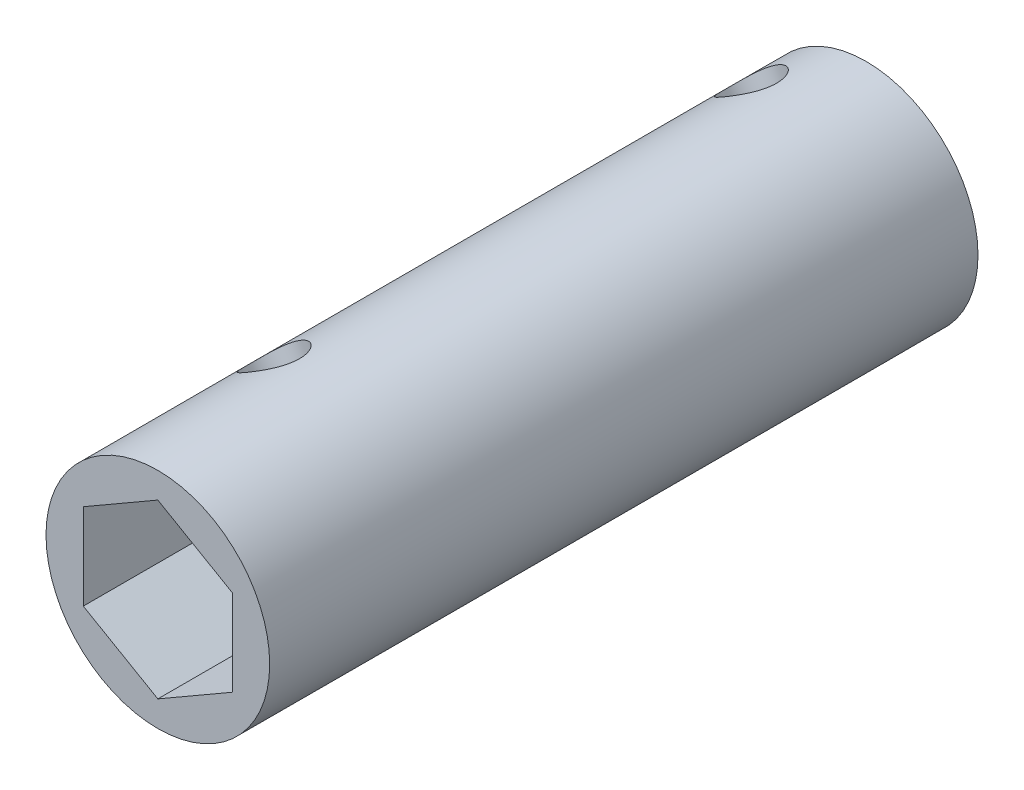
ISO-10303-21;
HEADER;
FILE_DESCRIPTION(('STEP AP214'),'2;1');
FILE_NAME('part.step','',(''),(''),'','','');
FILE_SCHEMA(('AUTOMOTIVE_DESIGN { 1 0 10303 214 1 1 1 1 }'));
ENDSEC;
DATA;
#1=APPLICATION_CONTEXT('core data for automotive mechanical design processes');
#2=APPLICATION_PROTOCOL_DEFINITION('international standard','automotive_design',2000,#1);
#3=PRODUCT_CONTEXT('',#1,'mechanical');
#4=PRODUCT('Part','Part','',(#3));
#5=PRODUCT_RELATED_PRODUCT_CATEGORY('part','',(#4));
#6=PRODUCT_DEFINITION_FORMATION('','',#4);
#7=PRODUCT_DEFINITION_CONTEXT('part definition',#1,'design');
#8=PRODUCT_DEFINITION('design','',#6,#7);
#9=PRODUCT_DEFINITION_SHAPE('','',#8);
#10=(LENGTH_UNIT() NAMED_UNIT(*) SI_UNIT(.MILLI.,.METRE.));
#11=(NAMED_UNIT(*) PLANE_ANGLE_UNIT() SI_UNIT($,.RADIAN.));
#12=(NAMED_UNIT(*) SI_UNIT($,.STERADIAN.) SOLID_ANGLE_UNIT());
#13=UNCERTAINTY_MEASURE_WITH_UNIT(LENGTH_MEASURE(1.E-05),#10,'distance_accuracy_value','');
#14=(GEOMETRIC_REPRESENTATION_CONTEXT(3) GLOBAL_UNCERTAINTY_ASSIGNED_CONTEXT((#13)) GLOBAL_UNIT_ASSIGNED_CONTEXT((#10,
#11,#12)) REPRESENTATION_CONTEXT('',''));
#15=CARTESIAN_POINT('',(0.,0.,0.));
#16=DIRECTION('',(0.,0.,1.));
#17=DIRECTION('',(1.,0.,0.));
#18=AXIS2_PLACEMENT_3D('',#15,#16,#17);
#19=CARTESIAN_POINT('',(0.,0.,60.325));
#20=DIRECTION('',(0.,0.,1.));
#21=DIRECTION('',(1.,0.,0.));
#22=AXIS2_PLACEMENT_3D('',#19,#20,#21);
#23=PLANE('',#22);
#24=CARTESIAN_POINT('',(0.,0.,60.325));
#25=DIRECTION('',(0.,0.,1.));
#26=DIRECTION('',(1.,0.,0.));
#27=AXIS2_PLACEMENT_3D('',#24,#25,#26);
#28=CIRCLE('',#27,9.525);
#29=CARTESIAN_POINT('',(9.525,0.,60.325));
#30=VERTEX_POINT('',#29);
#31=EDGE_CURVE('E11',#30,#30,#28,.T.);
#32=ORIENTED_EDGE('',*,*,#31,.T.);
#33=EDGE_LOOP('',(#32));
#34=FACE_BOUND('',#33,.T.);
#35=DIRECTION('',(-0.866025403784439,0.5,0.));
#36=VECTOR('',#35,1.);
#37=CARTESIAN_POINT('',(6.35,3.66617420935412,60.325));
#38=LINE('',#37,#36);
#39=CARTESIAN_POINT('',(6.35,3.66617420935412,60.325));
#40=VERTEX_POINT('',#39);
#41=CARTESIAN_POINT('',(0.,7.33234841870824,60.325));
#42=VERTEX_POINT('',#41);
#43=EDGE_CURVE('E105',#40,#42,#38,.T.);
#44=ORIENTED_EDGE('',*,*,#43,.F.);
#45=DIRECTION('',(0.,1.,0.));
#46=VECTOR('',#45,1.);
#47=CARTESIAN_POINT('',(6.35,-3.66617420935413,60.325));
#48=LINE('',#47,#46);
#49=CARTESIAN_POINT('',(6.35,-3.66617420935413,60.325));
#50=VERTEX_POINT('',#49);
#51=EDGE_CURVE('E97',#50,#40,#48,.T.);
#52=ORIENTED_EDGE('',*,*,#51,.F.);
#53=DIRECTION('',(0.866025403784439,0.5,0.));
#54=VECTOR('',#53,1.);
#55=CARTESIAN_POINT('',(0.,-7.33234841870825,60.325));
#56=LINE('',#55,#54);
#57=CARTESIAN_POINT('',(0.,-7.33234841870825,60.325));
#58=VERTEX_POINT('',#57);
#59=EDGE_CURVE('E126',#58,#50,#56,.T.);
#60=ORIENTED_EDGE('',*,*,#59,.F.);
#61=DIRECTION('',(0.866025403784439,-0.5,0.));
#62=VECTOR('',#61,1.);
#63=CARTESIAN_POINT('',(-6.34999999999999,-3.66617420935413,60.325));
#64=LINE('',#63,#62);
#65=CARTESIAN_POINT('',(-6.34999999999999,-3.66617420935413,60.325));
#66=VERTEX_POINT('',#65);
#67=EDGE_CURVE('E124',#66,#58,#64,.T.);
#68=ORIENTED_EDGE('',*,*,#67,.F.);
#69=DIRECTION('',(0.,-1.,0.));
#70=VECTOR('',#69,1.);
#71=CARTESIAN_POINT('',(-6.35,3.66617420935412,60.325));
#72=LINE('',#71,#70);
#73=CARTESIAN_POINT('',(-6.35,3.66617420935412,60.325));
#74=VERTEX_POINT('',#73);
#75=EDGE_CURVE('E119',#74,#66,#72,.T.);
#76=ORIENTED_EDGE('',*,*,#75,.F.);
#77=DIRECTION('',(-0.866025403784439,-0.5,0.));
#78=VECTOR('',#77,1.);
#79=CARTESIAN_POINT('',(0.,7.33234841870824,60.325));
#80=LINE('',#79,#78);
#81=EDGE_CURVE('E117',#42,#74,#80,.T.);
#82=ORIENTED_EDGE('',*,*,#81,.F.);
#83=EDGE_LOOP('',(#44,#52,#60,#68,#76,#82));
#84=FACE_BOUND('',#83,.T.);
#85=ADVANCED_FACE('F41',(#34,#84),#23,.T.);
#86=CARTESIAN_POINT('',(0.,0.,0.));
#87=DIRECTION('',(0.,0.,1.));
#88=DIRECTION('',(1.,0.,0.));
#89=AXIS2_PLACEMENT_3D('',#86,#87,#88);
#90=PLANE('',#89);
#91=CARTESIAN_POINT('',(0.,0.,0.));
#92=DIRECTION('',(0.,0.,1.));
#93=DIRECTION('',(1.,0.,0.));
#94=AXIS2_PLACEMENT_3D('',#91,#92,#93);
#95=CIRCLE('',#94,9.525);
#96=CARTESIAN_POINT('',(9.525,0.,0.));
#97=VERTEX_POINT('',#96);
#98=EDGE_CURVE('E51',#97,#97,#95,.T.);
#99=ORIENTED_EDGE('',*,*,#98,.F.);
#100=EDGE_LOOP('',(#99));
#101=FACE_BOUND('',#100,.T.);
#102=DIRECTION('',(0.,1.,0.));
#103=VECTOR('',#102,1.);
#104=CARTESIAN_POINT('',(6.35,-3.66617420935413,0.));
#105=LINE('',#104,#103);
#106=CARTESIAN_POINT('',(6.35,-3.66617420935413,0.));
#107=VERTEX_POINT('',#106);
#108=CARTESIAN_POINT('',(6.35,3.66617420935412,0.));
#109=VERTEX_POINT('',#108);
#110=EDGE_CURVE('E67',#107,#109,#105,.T.);
#111=ORIENTED_EDGE('',*,*,#110,.T.);
#112=DIRECTION('',(-0.866025403784439,0.5,0.));
#113=VECTOR('',#112,1.);
#114=CARTESIAN_POINT('',(6.35,3.66617420935412,0.));
#115=LINE('',#114,#113);
#116=CARTESIAN_POINT('',(0.,7.33234841870824,0.));
#117=VERTEX_POINT('',#116);
#118=EDGE_CURVE('E112',#109,#117,#115,.T.);
#119=ORIENTED_EDGE('',*,*,#118,.T.);
#120=DIRECTION('',(-0.866025403784439,-0.5,0.));
#121=VECTOR('',#120,1.);
#122=CARTESIAN_POINT('',(0.,7.33234841870824,0.));
#123=LINE('',#122,#121);
#124=CARTESIAN_POINT('',(-6.35,3.66617420935412,0.));
#125=VERTEX_POINT('',#124);
#126=EDGE_CURVE('E131',#117,#125,#123,.T.);
#127=ORIENTED_EDGE('',*,*,#126,.T.);
#128=DIRECTION('',(0.,-1.,0.));
#129=VECTOR('',#128,1.);
#130=CARTESIAN_POINT('',(-6.35,3.66617420935412,0.));
#131=LINE('',#130,#129);
#132=CARTESIAN_POINT('',(-6.34999999999999,-3.66617420935413,0.));
#133=VERTEX_POINT('',#132);
#134=EDGE_CURVE('E134',#125,#133,#131,.T.);
#135=ORIENTED_EDGE('',*,*,#134,.T.);
#136=DIRECTION('',(0.866025403784439,-0.5,0.));
#137=VECTOR('',#136,1.);
#138=CARTESIAN_POINT('',(-6.34999999999999,-3.66617420935413,0.));
#139=LINE('',#138,#137);
#140=CARTESIAN_POINT('',(0.,-7.33234841870825,0.));
#141=VERTEX_POINT('',#140);
#142=EDGE_CURVE('E137',#133,#141,#139,.T.);
#143=ORIENTED_EDGE('',*,*,#142,.T.);
#144=DIRECTION('',(0.866025403784439,0.5,0.));
#145=VECTOR('',#144,1.);
#146=CARTESIAN_POINT('',(0.,-7.33234841870825,0.));
#147=LINE('',#146,#145);
#148=EDGE_CURVE('E106',#141,#107,#147,.T.);
#149=ORIENTED_EDGE('',*,*,#148,.T.);
#150=EDGE_LOOP('',(#111,#119,#127,#135,#143,#149));
#151=FACE_BOUND('',#150,.T.);
#152=ADVANCED_FACE('F202',(#101,#151),#90,.F.);
#153=CARTESIAN_POINT('',(0.,0.,60.325));
#154=DIRECTION('',(0.,0.,-1.));
#155=DIRECTION('',(-1.,0.,0.));
#156=AXIS2_PLACEMENT_3D('',#153,#154,#155);
#157=CYLINDRICAL_SURFACE('',#156,9.525);
#158=CARTESIAN_POINT('',(2.54904780381651,-9.17758030713206,5.08));
#159=CARTESIAN_POINT('',(2.54905229363295,-9.17758061344205,5.21149334025756));
#160=CARTESIAN_POINT('',(2.55993384077204,-9.17457797390514,5.34302801599129));
#161=CARTESIAN_POINT('',(2.6029817332676,-9.16245566720171,5.60232011821027));
#162=CARTESIAN_POINT('',(2.63516046621715,-9.1533324399287,5.73007530113095));
#163=CARTESIAN_POINT('',(2.71934494253332,-9.12867433907222,5.97802037012329));
#164=CARTESIAN_POINT('',(2.77132508942243,-9.11314774073283,6.09821979050489));
#165=CARTESIAN_POINT('',(2.893035348316,-9.07524198547898,6.32807108704424));
#166=CARTESIAN_POINT('',(2.96276621389893,-9.05286253762954,6.43772251513141));
#167=CARTESIAN_POINT('',(3.11899373347353,-9.00024516889423,6.64577821711226));
#168=CARTESIAN_POINT('',(3.20579560114475,-8.96986013093974,6.74391615433342));
#169=CARTESIAN_POINT('',(3.39224146692954,-8.90102140437571,6.92381272812822));
#170=CARTESIAN_POINT('',(3.49188666422141,-8.86256696211717,7.00556983340472));
#171=CARTESIAN_POINT('',(3.70221396050843,-8.77680428814681,7.15147363291879));
#172=CARTESIAN_POINT('',(3.81303066091311,-8.72938000317114,7.2153586847238));
#173=CARTESIAN_POINT('',(4.04082926959016,-8.6262929657193,7.32200368605581));
#174=CARTESIAN_POINT('',(4.15781026540683,-8.57063143034972,7.36476675244953));
#175=CARTESIAN_POINT('',(4.39168967427931,-8.45313308235405,7.4271008124361));
#176=CARTESIAN_POINT('',(4.50854175187616,-8.39144421303591,7.44712408622107));
#177=CARTESIAN_POINT('',(4.74081493875507,-8.2624412439009,7.46482985625997));
#178=CARTESIAN_POINT('',(4.85623625707456,-8.19512797721623,7.46251565552964));
#179=CARTESIAN_POINT('',(5.0797186533123,-8.05846571853376,7.43593745513674));
#180=CARTESIAN_POINT('',(5.18788622087936,-7.98919504164947,7.4121616503862));
#181=CARTESIAN_POINT('',(5.3968168648691,-7.84957260579019,7.34411986527881));
#182=CARTESIAN_POINT('',(5.49757954680107,-7.77922078945922,7.29985279417802));
#183=CARTESIAN_POINT('',(5.69030416989731,-7.63939650735584,7.19169005142057));
#184=CARTESIAN_POINT('',(5.78217836592552,-7.56993773044561,7.12762063995969));
#185=CARTESIAN_POINT('',(5.95431049924959,-7.43530565734453,6.98180371564176));
#186=CARTESIAN_POINT('',(6.03456641151963,-7.37013310930587,6.900053127196));
#187=CARTESIAN_POINT('',(6.18410203551371,-7.24515508260776,6.7185774232618));
#188=CARTESIAN_POINT('',(6.25302589271482,-7.18554260063019,6.61842571503877));
#189=CARTESIAN_POINT('',(6.37605592968952,-7.07660283159918,6.40435602520288));
#190=CARTESIAN_POINT('',(6.43016141690835,-7.02727602528515,6.29043740053472));
#191=CARTESIAN_POINT('',(6.52288847932546,-6.94129579382732,6.05127374247321));
#192=CARTESIAN_POINT('',(6.56143370244015,-6.90470498042435,5.92597646687705));
#193=CARTESIAN_POINT('',(6.62196022932753,-6.84668129461498,5.66808734165681));
#194=CARTESIAN_POINT('',(6.64394507769142,-6.82524517854973,5.53549705955467));
#195=CARTESIAN_POINT('',(6.6705752897347,-6.79921985587541,5.27053857479275));
#196=CARTESIAN_POINT('',(6.67566329006416,-6.79420063979761,5.13825700184267));
#197=CARTESIAN_POINT('',(6.66964484024437,-6.80010886481148,4.87442960540254));
#198=CARTESIAN_POINT('',(6.65853988085245,-6.81103483795619,4.74288371530316));
#199=CARTESIAN_POINT('',(6.62066792194018,-6.84785021203948,4.48648366263648));
#200=CARTESIAN_POINT('',(6.59416015026167,-6.87349186342222,4.36155522794284));
#201=CARTESIAN_POINT('',(6.52615192018632,-6.93809425809366,4.1194690363947));
#202=CARTESIAN_POINT('',(6.48464968575974,-6.97705657912911,4.00231220199936));
#203=CARTESIAN_POINT('',(6.38635757570423,-7.06714767400292,3.77655968283178));
#204=CARTESIAN_POINT('',(6.32928377083355,-7.11850012554794,3.66817702985906));
#205=CARTESIAN_POINT('',(6.20112529126727,-7.23041442347494,3.4653330844316));
#206=CARTESIAN_POINT('',(6.13003831391223,-7.29097778302894,3.37087408439077));
#207=CARTESIAN_POINT('',(5.97303683874989,-7.42017707150564,3.1961349819512));
#208=CARTESIAN_POINT('',(5.88679584286063,-7.48897706968816,3.11626879042226));
#209=CARTESIAN_POINT('',(5.70238161212303,-7.63033065001022,2.97598858672893));
#210=CARTESIAN_POINT('',(5.60420900003335,-7.70288403613202,2.91557355993068));
#211=CARTESIAN_POINT('',(5.39882155536816,-7.84818729915137,2.81643515211215));
#212=CARTESIAN_POINT('',(5.29167840204569,-7.92093182251274,2.77755576912894));
#213=CARTESIAN_POINT('',(5.0704520816802,-8.06433488929517,2.72212403128549));
#214=CARTESIAN_POINT('',(4.95637025842815,-8.13499383271193,2.70556736755107));
#215=CARTESIAN_POINT('',(4.72767678849472,-8.26993669412325,2.69549342732325));
#216=CARTESIAN_POINT('',(4.61316287025551,-8.33434132579849,2.70136530521656));
#217=CARTESIAN_POINT('',(4.38402560845031,-8.45711779719425,2.73458263874467));
#218=CARTESIAN_POINT('',(4.26940226823992,-8.51548981627303,2.76192745575011));
#219=CARTESIAN_POINT('',(4.0441492787384,-8.62473658142619,2.83698684832936));
#220=CARTESIAN_POINT('',(3.93350145175549,-8.67564999652782,2.88459097320487));
#221=CARTESIAN_POINT('',(3.71889779529251,-8.76978739471325,2.99871744129036));
#222=CARTESIAN_POINT('',(3.61494281142062,-8.81301040736398,3.06524216929659));
#223=CARTESIAN_POINT('',(3.41452745499388,-8.89261172000423,3.21718440095329));
#224=CARTESIAN_POINT('',(3.31830629654328,-8.92880123245951,3.30301634028975));
#225=CARTESIAN_POINT('',(3.1393582537879,-8.99328203277393,3.49033191627106));
#226=CARTESIAN_POINT('',(3.05663479658151,-9.0215713160394,3.59181951523971));
#227=CARTESIAN_POINT('',(2.90620591590505,-9.07116295467689,3.80984461753865));
#228=CARTESIAN_POINT('',(2.83880945928833,-9.09232511646503,3.92662756876351));
#229=CARTESIAN_POINT('',(2.72377748435526,-9.12744783640375,4.17049463526441));
#230=CARTESIAN_POINT('',(2.67612758971469,-9.14141363561731,4.29757117551097));
#231=CARTESIAN_POINT('',(2.60957587047935,-9.16060528619542,4.53368650943248));
#232=CARTESIAN_POINT('',(2.58694292776004,-9.16698406212902,4.64159559769449));
#233=CARTESIAN_POINT('',(2.5566776531051,-9.17547126212705,4.85966024430074));
#234=CARTESIAN_POINT('',(2.54904404159035,-9.17758005046066,4.96981561020698));
#235=CARTESIAN_POINT('',(2.54904780381651,-9.17758030713206,5.08));
#236=B_SPLINE_CURVE_WITH_KNOTS('',3,(#158,#159,#160,#161,#162,#163,#164,#165,#166,#167,#168,
#169,#170,#171,#172,#173,#174,#175,#176,#177,#178,#179,#180,#181,#182,#183,#184,#185,#186,#187,
#188,#189,#190,#191,#192,#193,#194,#195,#196,#197,#198,#199,#200,#201,#202,#203,#204,#205,#206,
#207,#208,#209,#210,#211,#212,#213,#214,#215,#216,#217,#218,#219,#220,#221,#222,#223,#224,#225,
#226,#227,#228,#229,#230,#231,#232,#233,#234,#235),.UNSPECIFIED.,.T.,.F.,(4,2,2,2,2,2,2,2,2,2,2,
2,2,2,2,2,2,2,2,2,2,2,2,2,2,2,2,2,2,2,2,2,2,2,2,2,2,2,4),(0.,0.394075388253669,
0.788380193710805,1.18217701762563,1.57599056234593,1.9776181636881,2.37928329209573,
2.78655300319019,3.19376259754356,3.59272285323068,3.99162411604385,4.38167395211222,
4.77174455280359,5.16533962727358,5.5590032215914,5.96332119409746,6.36765805967812,
6.77395551488003,7.18016598123394,7.57564754962905,7.97109271147282,8.3600677827598,
8.7490889415861,9.14574160685557,9.54245950492715,9.94910377749176,10.3557268347758,
10.7593644935331,11.1629242284057,11.5555723244111,11.9482087430628,12.3387314492783,
12.7293033997022,13.1292323449913,13.5292626757086,13.936755946198,14.343952021097,
14.674194303944,15.0044084129029),.UNSPECIFIED.);
#237=CARTESIAN_POINT('',(2.54904780381651,-9.17758030713206,5.08));
#238=VERTEX_POINT('',#237);
#239=EDGE_CURVE('E129',#238,#238,#236,.T.);
#240=ORIENTED_EDGE('',*,*,#239,.T.);
#241=EDGE_LOOP('',(#240));
#242=FACE_BOUND('',#241,.T.);
#243=CARTESIAN_POINT('',(-6.6734937893399,6.79633030713207,5.08));
#244=CARTESIAN_POINT('',(-6.67349180970392,6.79633434858216,4.94850665974244));
#245=CARTESIAN_POINT('',(-6.66545067401699,6.80425672506863,4.81697198400871));
#246=CARTESIAN_POINT('',(-6.63342850221157,6.83547614019744,4.55767988178973));
#247=CARTESIAN_POINT('',(-6.60943818915388,6.85878212675685,4.42992469886905));
#248=CARTESIAN_POINT('',(-6.545991409245,6.91935897142271,4.18197962987671));
#249=CARTESIAN_POINT('',(-6.50655490720417,6.95661179995143,4.06178020949511));
#250=CARTESIAN_POINT('',(-6.41287243075792,7.04306309842752,3.83192891295576));
#251=CARTESIAN_POINT('',(-6.35862582760617,7.09226207552549,3.72227748486859));
#252=CARTESIAN_POINT('',(-6.2349440898138,7.20125039187966,3.51422178288774));
#253=CARTESIAN_POINT('',(-6.16522894121464,7.26123049540163,3.41608384566658));
#254=CARTESIAN_POINT('',(-6.01238992235363,7.38827798831983,3.23618727187178));
#255=CARTESIAN_POINT('',(-5.92926479982344,7.45534603941043,3.15443016659529));
#256=CARTESIAN_POINT('',(-5.74982849732511,7.59461348411911,3.00852636708121));
#257=CARTESIAN_POINT('',(-5.65334951157753,7.66687141934529,2.9446413152762));
#258=CARTESIAN_POINT('',(-5.45017421400484,7.81260728268044,2.83799631394419));
#259=CARTESIAN_POINT('',(-5.3434794124528,7.8860850291329,2.79523324755047));
#260=CARTESIAN_POINT('',(-5.12478315374961,8.02988136464071,2.7328991875639));
#261=CARTESIAN_POINT('',(-5.01293298699093,8.10023379766551,2.71287591377893));
#262=CARTESIAN_POINT('',(-4.78507654511693,8.23688679355311,2.69517014374004));
#263=CARTESIAN_POINT('',(-4.66907088699655,8.30318795401374,2.69748434447036));
#264=CARTESIAN_POINT('',(-4.43897670112011,8.42839825711301,2.72406254486326));
#265=CARTESIAN_POINT('',(-4.32490275141743,8.48743878004951,2.7478383496138));
#266=CARTESIAN_POINT('',(-4.09952085303016,8.59856680744403,2.8158801347212));
#267=CARTESIAN_POINT('',(-3.98821305191918,8.65065394158508,2.86014720582198));
#268=CARTESIAN_POINT('',(-3.77075936000361,8.74764622006951,2.96830994857943));
#269=CARTESIAN_POINT('',(-3.66466919666945,8.7924822193271,3.03237936004031));
#270=CARTESIAN_POINT('',(-3.46200833453771,8.87423698304282,3.17819628435824));
#271=CARTESIAN_POINT('',(-3.36543929617186,8.91115436785324,3.259946872804));
#272=CARTESIAN_POINT('',(-3.1824373381394,8.97816700365381,3.44142257673821));
#273=CARTESIAN_POINT('',(-3.09634948576363,9.008050573928,3.54157428496123));
#274=CARTESIAN_POINT('',(-2.94048985981301,9.06012782686112,3.75564397479712));
#275=CARTESIAN_POINT('',(-2.87071884884809,9.08232115011975,3.86956259946528));
#276=CARTESIAN_POINT('',(-2.7498942529738,9.11963502606236,4.10872625752679));
#277=CARTESIAN_POINT('',(-2.69893306746434,9.13472076177273,4.23402353312295));
#278=CARTESIAN_POINT('',(-2.61841981808853,9.15812642875536,4.49191265834319));
#279=CARTESIAN_POINT('',(-2.58886317283561,9.16644780790421,4.62450294044533));
#280=CARTESIAN_POINT('',(-2.55300947623632,9.1764975867047,4.88946142520725));
#281=CARTESIAN_POINT('',(-2.54611870744113,9.17839431620557,5.02174299815733));
#282=CARTESIAN_POINT('',(-2.55424460530431,9.17613629827717,5.28557039459746));
#283=CARTESIAN_POINT('',(-2.56925925530466,9.17198210790813,5.41711628469684));
#284=CARTESIAN_POINT('',(-2.62007828396675,9.15759171644066,5.67351633736352));
#285=CARTESIAN_POINT('',(-2.65553849129843,9.14745613846073,5.79844477205716));
#286=CARTESIAN_POINT('',(-2.7454899212669,9.12086048088478,6.0405309636053));
#287=CARTESIAN_POINT('',(-2.79998339828729,9.10439965207527,6.15768779800063));
#288=CARTESIAN_POINT('',(-2.92715063013051,9.06432173521253,6.38344031716822));
#289=CARTESIAN_POINT('',(-3.00016006015046,9.04057059607639,6.49182297014094));
#290=CARTESIAN_POINT('',(-3.16115992498507,8.9855392460251,6.69466691556841));
#291=CARTESIAN_POINT('',(-3.24915282157489,8.95425779753439,6.78912591560923));
#292=CARTESIAN_POINT('',(-3.43954342512775,8.88289017585052,6.9638650180488));
#293=CARTESIAN_POINT('',(-3.54224646927877,8.84260328165402,7.04373120957774));
#294=CARTESIAN_POINT('',(-3.75686937612236,8.75357266317692,7.18401141327107));
#295=CARTESIAN_POINT('',(-3.86878875767925,8.70482938021228,7.24442644006932));
#296=CARTESIAN_POINT('',(-4.09731879703938,8.59961026702353,7.34356484788785));
#297=CARTESIAN_POINT('',(-4.21388897891775,8.54319383608538,7.38244423087106));
#298=CARTESIAN_POINT('',(-4.44869283791468,8.42330775605433,7.43787596871451));
#299=CARTESIAN_POINT('',(-4.56692618954419,8.35983947071639,7.45443263244893));
#300=CARTESIAN_POINT('',(-4.79813687055247,8.22925654678009,7.46450657267675));
#301=CARTESIAN_POINT('',(-4.91116987682422,8.16228690033565,7.45863469478344));
#302=CARTESIAN_POINT('',(-5.13206605094256,8.02523644635663,7.42541736125533));
#303=CARTESIAN_POINT('',(-5.23992937244016,7.95515573140719,7.39807254424989));
#304=CARTESIAN_POINT('',(-5.44716634109483,7.81470430279707,7.32301315167064));
#305=CARTESIAN_POINT('',(-5.54658256545772,7.74433718130714,7.27540902679513));
#306=CARTESIAN_POINT('',(-5.73540977196396,7.60555366215789,7.16128255870964));
#307=CARTESIAN_POINT('',(-5.82481949088354,7.53713751160019,7.09475783070341));
#308=CARTESIAN_POINT('',(-5.99396392801795,7.40337337794624,6.94281559904671));
#309=CARTESIAN_POINT('',(-6.0734155443801,7.33813816657411,6.85698365971025));
#310=CARTESIAN_POINT('',(-6.21873157688642,7.21540501574765,6.66966808372894));
#311=CARTESIAN_POINT('',(-6.28459254345237,7.15790904195077,6.56818048476029));
#312=CARTESIAN_POINT('',(-6.40275460266597,7.05242962914085,6.35015538246135));
#313=CARTESIAN_POINT('',(-6.45477980068185,7.00464366647978,6.23337243123649));
#314=CARTESIAN_POINT('',(-6.54271295586533,6.92258441390961,5.98950536473559));
#315=CARTESIAN_POINT('',(-6.57863264008871,6.88830129427,5.86242882448903));
#316=CARTESIAN_POINT('',(-6.62852895664757,6.84026164003573,5.62631349056753));
#317=CARTESIAN_POINT('',(-6.64536961001077,6.8238503246452,5.51840440230551));
#318=CARTESIAN_POINT('',(-6.66785237814354,6.80188342794053,5.30033975569926));
#319=CARTESIAN_POINT('',(-6.67349544816903,6.79632692061294,5.19018438979302));
#320=CARTESIAN_POINT('',(-6.6734937893399,6.79633030713207,5.08));
#321=B_SPLINE_CURVE_WITH_KNOTS('',3,(#243,#244,#245,#246,#247,#248,#249,#250,#251,#252,#253,
#254,#255,#256,#257,#258,#259,#260,#261,#262,#263,#264,#265,#266,#267,#268,#269,#270,#271,#272,
#273,#274,#275,#276,#277,#278,#279,#280,#281,#282,#283,#284,#285,#286,#287,#288,#289,#290,#291,
#292,#293,#294,#295,#296,#297,#298,#299,#300,#301,#302,#303,#304,#305,#306,#307,#308,#309,#310,
#311,#312,#313,#314,#315,#316,#317,#318,#319,#320),.UNSPECIFIED.,.T.,.F.,(4,2,2,2,2,2,2,2,2,2,2,
2,2,2,2,2,2,2,2,2,2,2,2,2,2,2,2,2,2,2,2,2,2,2,2,2,2,2,4),(0.,0.394075388253671,
0.788380193710805,1.18217701762564,1.57599056234593,1.9776181636881,2.37928329209573,
2.78655300319019,3.19376259754355,3.59272285323067,3.99162411604384,4.38167395211222,
4.77174455280359,5.16533962727358,5.5590032215914,5.96332119409746,6.36765805967811,
6.77395551488003,7.18016598123394,7.57564754962905,7.97109271147282,8.3600677827598,
8.7490889415861,9.14574160685557,9.54245950492715,9.94910377749176,10.3557268347758,
10.7593644935331,11.1629242284057,11.5555723244111,11.9482087430628,12.3387314492783,
12.7293033997022,13.1292323449913,13.5292626757086,13.936755946198,14.343952021097,
14.674194303944,15.0044084129029),.UNSPECIFIED.);
#322=CARTESIAN_POINT('',(-6.6734937893399,6.79633030713207,5.08));
#323=VERTEX_POINT('',#322);
#324=EDGE_CURVE('E228',#323,#323,#321,.T.);
#325=ORIENTED_EDGE('',*,*,#324,.T.);
#326=EDGE_LOOP('',(#325));
#327=FACE_BOUND('',#326,.T.);
#328=CARTESIAN_POINT('',(2.54904780381651,-9.17758030713206,45.72));
#329=CARTESIAN_POINT('',(2.54905229363295,-9.17758061344205,45.8514933402576));
#330=CARTESIAN_POINT('',(2.55993384077204,-9.17457797390514,45.9830280159913));
#331=CARTESIAN_POINT('',(2.6029817332676,-9.16245566720171,46.2423201182103));
#332=CARTESIAN_POINT('',(2.63516046621715,-9.1533324399287,46.3700753011309));
#333=CARTESIAN_POINT('',(2.71934494253332,-9.12867433907222,46.6180203701233));
#334=CARTESIAN_POINT('',(2.77132508942243,-9.11314774073283,46.7382197905049));
#335=CARTESIAN_POINT('',(2.893035348316,-9.07524198547898,46.9680710870442));
#336=CARTESIAN_POINT('',(2.96276621389893,-9.05286253762954,47.0777225151314));
#337=CARTESIAN_POINT('',(3.11899373347352,-9.00024516889423,47.2857782171123));
#338=CARTESIAN_POINT('',(3.20579560114475,-8.96986013093974,47.3839161543334));
#339=CARTESIAN_POINT('',(3.39224146692954,-8.90102140437571,47.5638127281282));
#340=CARTESIAN_POINT('',(3.49188666422141,-8.86256696211717,47.6455698334047));
#341=CARTESIAN_POINT('',(3.70221396050843,-8.77680428814681,47.7914736329188));
#342=CARTESIAN_POINT('',(3.8130306609131,-8.72938000317114,47.8553586847238));
#343=CARTESIAN_POINT('',(4.04082926959015,-8.6262929657193,47.9620036860558));
#344=CARTESIAN_POINT('',(4.15781026540683,-8.57063143034972,48.0047667524495));
#345=CARTESIAN_POINT('',(4.3916896742793,-8.45313308235405,48.0671008124361));
#346=CARTESIAN_POINT('',(4.50854175187616,-8.39144421303591,48.0871240862211));
#347=CARTESIAN_POINT('',(4.74081493875507,-8.2624412439009,48.10482985626));
#348=CARTESIAN_POINT('',(4.85623625707455,-8.19512797721623,48.1025156555296));
#349=CARTESIAN_POINT('',(5.07971865331229,-8.05846571853377,48.0759374551367));
#350=CARTESIAN_POINT('',(5.18788622087936,-7.98919504164947,48.0521616503862));
#351=CARTESIAN_POINT('',(5.3968168648691,-7.84957260579019,47.9841198652788));
#352=CARTESIAN_POINT('',(5.49757954680106,-7.77922078945923,47.939852794178));
#353=CARTESIAN_POINT('',(5.6903041698973,-7.63939650735584,47.8316900514206));
#354=CARTESIAN_POINT('',(5.78217836592551,-7.56993773044562,47.7676206399597));
#355=CARTESIAN_POINT('',(5.95431049924959,-7.43530565734453,47.6218037156418));
#356=CARTESIAN_POINT('',(6.03456641151962,-7.37013310930587,47.540053127196));
#357=CARTESIAN_POINT('',(6.18410203551371,-7.24515508260776,47.3585774232618));
#358=CARTESIAN_POINT('',(6.25302589271482,-7.18554260063019,47.2584257150388));
#359=CARTESIAN_POINT('',(6.37605592968952,-7.07660283159918,47.0443560252029));
#360=CARTESIAN_POINT('',(6.43016141690835,-7.02727602528515,46.9304374005347));
#361=CARTESIAN_POINT('',(6.52288847932546,-6.94129579382732,46.6912737424732));
#362=CARTESIAN_POINT('',(6.56143370244015,-6.90470498042435,46.565976466877));
#363=CARTESIAN_POINT('',(6.62196022932754,-6.84668129461498,46.3080873416568));
#364=CARTESIAN_POINT('',(6.64394507769142,-6.82524517854973,46.1754970595547));
#365=CARTESIAN_POINT('',(6.6705752897347,-6.79921985587541,45.9105385747927));
#366=CARTESIAN_POINT('',(6.67566329006415,-6.79420063979761,45.7782570018427));
#367=CARTESIAN_POINT('',(6.66964484024437,-6.80010886481149,45.5144296054025));
#368=CARTESIAN_POINT('',(6.65853988085245,-6.81103483795619,45.3828837153032));
#369=CARTESIAN_POINT('',(6.62066792194018,-6.84785021203948,45.1264836626365));
#370=CARTESIAN_POINT('',(6.59416015026167,-6.87349186342221,45.0015552279428));
#371=CARTESIAN_POINT('',(6.52615192018632,-6.93809425809366,44.7594690363947));
#372=CARTESIAN_POINT('',(6.48464968575974,-6.97705657912911,44.6423122019994));
#373=CARTESIAN_POINT('',(6.38635757570423,-7.06714767400291,44.4165596828318));
#374=CARTESIAN_POINT('',(6.32928377083355,-7.11850012554794,44.3081770298591));
#375=CARTESIAN_POINT('',(6.20112529126727,-7.23041442347494,44.1053330844316));
#376=CARTESIAN_POINT('',(6.13003831391223,-7.29097778302894,44.0108740843908));
#377=CARTESIAN_POINT('',(5.97303683874989,-7.42017707150563,43.8361349819512));
#378=CARTESIAN_POINT('',(5.88679584286064,-7.48897706968816,43.7562687904223));
#379=CARTESIAN_POINT('',(5.70238161212303,-7.63033065001021,43.6159885867289));
#380=CARTESIAN_POINT('',(5.60420900003336,-7.70288403613202,43.5555735599307));
#381=CARTESIAN_POINT('',(5.39882155536816,-7.84818729915137,43.4564351521121));
#382=CARTESIAN_POINT('',(5.29167840204569,-7.92093182251274,43.4175557691289));
#383=CARTESIAN_POINT('',(5.0704520816802,-8.06433488929517,43.3621240312855));
#384=CARTESIAN_POINT('',(4.95637025842815,-8.13499383271193,43.3455673675511));
#385=CARTESIAN_POINT('',(4.72767678849473,-8.26993669412325,43.3354934273233));
#386=CARTESIAN_POINT('',(4.61316287025551,-8.33434132579849,43.3413653052166));
#387=CARTESIAN_POINT('',(4.38402560845031,-8.45711779719425,43.3745826387447));
#388=CARTESIAN_POINT('',(4.26940226823992,-8.51548981627303,43.4019274557501));
#389=CARTESIAN_POINT('',(4.04414927873841,-8.62473658142619,43.4769868483294));
#390=CARTESIAN_POINT('',(3.9335014517555,-8.67564999652782,43.5245909732049));
#391=CARTESIAN_POINT('',(3.71889779529251,-8.76978739471325,43.6387174412904));
#392=CARTESIAN_POINT('',(3.61494281142063,-8.81301040736398,43.7052421692966));
#393=CARTESIAN_POINT('',(3.41452745499388,-8.89261172000423,43.8571844009533));
#394=CARTESIAN_POINT('',(3.31830629654329,-8.92880123245951,43.9430163402897));
#395=CARTESIAN_POINT('',(3.13935825378791,-8.99328203277393,44.1303319162711));
#396=CARTESIAN_POINT('',(3.05663479658151,-9.0215713160394,44.2318195152397));
#397=CARTESIAN_POINT('',(2.90620591590505,-9.07116295467689,44.4498446175386));
#398=CARTESIAN_POINT('',(2.83880945928833,-9.09232511646503,44.5666275687635));
#399=CARTESIAN_POINT('',(2.72377748435526,-9.12744783640375,44.8104946352644));
#400=CARTESIAN_POINT('',(2.67612758971469,-9.14141363561731,44.937571175511));
#401=CARTESIAN_POINT('',(2.60957587047935,-9.16060528619542,45.1736865094325));
#402=CARTESIAN_POINT('',(2.58694292776004,-9.16698406212902,45.2815955976945));
#403=CARTESIAN_POINT('',(2.5566776531051,-9.17547126212705,45.4996602443007));
#404=CARTESIAN_POINT('',(2.54904404159035,-9.17758005046066,45.609815610207));
#405=CARTESIAN_POINT('',(2.54904780381651,-9.17758030713206,45.72));
#406=B_SPLINE_CURVE_WITH_KNOTS('',3,(#328,#329,#330,#331,#332,#333,#334,#335,#336,#337,#338,
#339,#340,#341,#342,#343,#344,#345,#346,#347,#348,#349,#350,#351,#352,#353,#354,#355,#356,#357,
#358,#359,#360,#361,#362,#363,#364,#365,#366,#367,#368,#369,#370,#371,#372,#373,#374,#375,#376,
#377,#378,#379,#380,#381,#382,#383,#384,#385,#386,#387,#388,#389,#390,#391,#392,#393,#394,#395,
#396,#397,#398,#399,#400,#401,#402,#403,#404,#405),.UNSPECIFIED.,.T.,.F.,(4,2,2,2,2,2,2,2,2,2,2,
2,2,2,2,2,2,2,2,2,2,2,2,2,2,2,2,2,2,2,2,2,2,2,2,2,2,2,4),(0.,0.394075388253673,
0.788380193710801,1.18217701762562,1.57599056234593,1.97761816368809,2.37928329209573,
2.78655300319018,3.19376259754355,3.59272285323067,3.99162411604384,4.38167395211221,
4.77174455280358,5.16533962727358,5.55900322159139,5.96332119409746,6.36765805967811,
6.77395551488004,7.18016598123394,7.57564754962904,7.9710927114728,8.36006778275979,
8.7490889415861,9.14574160685557,9.54245950492715,9.94910377749175,10.3557268347758,
10.7593644935331,11.1629242284057,11.5555723244111,11.9482087430628,12.3387314492783,
12.7293033997022,13.1292323449913,13.5292626757086,13.936755946198,14.343952021097,
14.674194303944,15.0044084129029),.UNSPECIFIED.);
#407=CARTESIAN_POINT('',(2.54904780381651,-9.17758030713206,45.72));
#408=VERTEX_POINT('',#407);
#409=EDGE_CURVE('E161',#408,#408,#406,.T.);
#410=ORIENTED_EDGE('',*,*,#409,.T.);
#411=EDGE_LOOP('',(#410));
#412=FACE_BOUND('',#411,.T.);
#413=CARTESIAN_POINT('',(-6.6734937893399,6.79633030713207,45.72));
#414=CARTESIAN_POINT('',(-6.67349180970392,6.79633434858216,45.5885066597424));
#415=CARTESIAN_POINT('',(-6.66545067401699,6.80425672506863,45.4569719840087));
#416=CARTESIAN_POINT('',(-6.63342850221157,6.83547614019744,45.1976798817897));
#417=CARTESIAN_POINT('',(-6.60943818915387,6.85878212675685,45.0699246988691));
#418=CARTESIAN_POINT('',(-6.545991409245,6.91935897142271,44.8219796298767));
#419=CARTESIAN_POINT('',(-6.50655490720417,6.95661179995143,44.7017802094951));
#420=CARTESIAN_POINT('',(-6.41287243075792,7.04306309842752,44.4719289129558));
#421=CARTESIAN_POINT('',(-6.35862582760617,7.09226207552549,44.3622774848686));
#422=CARTESIAN_POINT('',(-6.23494408981379,7.20125039187966,44.1542217828877));
#423=CARTESIAN_POINT('',(-6.16522894121464,7.26123049540164,44.0560838456666));
#424=CARTESIAN_POINT('',(-6.01238992235362,7.38827798831983,43.8761872718718));
#425=CARTESIAN_POINT('',(-5.92926479982343,7.45534603941043,43.7944301665953));
#426=CARTESIAN_POINT('',(-5.7498284973251,7.59461348411911,43.6485263670812));
#427=CARTESIAN_POINT('',(-5.65334951157752,7.66687141934529,43.5846413152762));
#428=CARTESIAN_POINT('',(-5.45017421400483,7.81260728268045,43.4779963139442));
#429=CARTESIAN_POINT('',(-5.34347941245279,7.8860850291329,43.4352332475505));
#430=CARTESIAN_POINT('',(-5.1247831537496,8.02988136464072,43.3728991875639));
#431=CARTESIAN_POINT('',(-5.01293298699092,8.10023379766551,43.3528759137789));
#432=CARTESIAN_POINT('',(-4.78507654511693,8.23688679355312,43.33517014374));
#433=CARTESIAN_POINT('',(-4.66907088699655,8.30318795401374,43.3374843444704));
#434=CARTESIAN_POINT('',(-4.4389767011201,8.42839825711301,43.3640625448633));
#435=CARTESIAN_POINT('',(-4.32490275141743,8.48743878004951,43.3878383496138));
#436=CARTESIAN_POINT('',(-4.09952085303015,8.59856680744403,43.4558801347212));
#437=CARTESIAN_POINT('',(-3.98821305191918,8.65065394158508,43.500147205822));
#438=CARTESIAN_POINT('',(-3.7707593600036,8.74764622006951,43.6083099485794));
#439=CARTESIAN_POINT('',(-3.66466919666945,8.7924822193271,43.6723793600403));
#440=CARTESIAN_POINT('',(-3.46200833453771,8.87423698304282,43.8181962843582));
#441=CARTESIAN_POINT('',(-3.36543929617186,8.91115436785323,43.899946872804));
#442=CARTESIAN_POINT('',(-3.1824373381394,8.97816700365381,44.0814225767382));
#443=CARTESIAN_POINT('',(-3.09634948576363,9.008050573928,44.1815742849612));
#444=CARTESIAN_POINT('',(-2.94048985981301,9.06012782686112,44.3956439747971));
#445=CARTESIAN_POINT('',(-2.87071884884809,9.08232115011975,44.5095625994653));
#446=CARTESIAN_POINT('',(-2.7498942529738,9.11963502606236,44.7487262575268));
#447=CARTESIAN_POINT('',(-2.69893306746434,9.13472076177273,44.8740235331229));
#448=CARTESIAN_POINT('',(-2.61841981808853,9.15812642875536,45.1319126583432));
#449=CARTESIAN_POINT('',(-2.58886317283561,9.16644780790421,45.2645029404453));
#450=CARTESIAN_POINT('',(-2.55300947623632,9.1764975867047,45.5294614252073));
#451=CARTESIAN_POINT('',(-2.54611870744113,9.17839431620557,45.6617429981573));
#452=CARTESIAN_POINT('',(-2.55424460530432,9.17613629827717,45.9255703945975));
#453=CARTESIAN_POINT('',(-2.56925925530466,9.17198210790813,46.0571162846968));
#454=CARTESIAN_POINT('',(-2.62007828396675,9.15759171644066,46.3135163373635));
#455=CARTESIAN_POINT('',(-2.65553849129844,9.14745613846073,46.4384447720572));
#456=CARTESIAN_POINT('',(-2.7454899212669,9.12086048088478,46.6805309636053));
#457=CARTESIAN_POINT('',(-2.79998339828729,9.10439965207527,46.7976877980006));
#458=CARTESIAN_POINT('',(-2.92715063013051,9.06432173521253,47.0234403171682));
#459=CARTESIAN_POINT('',(-3.00016006015046,9.04057059607639,47.1318229701409));
#460=CARTESIAN_POINT('',(-3.16115992498508,8.9855392460251,47.3346669155684));
#461=CARTESIAN_POINT('',(-3.24915282157489,8.95425779753439,47.4291259156092));
#462=CARTESIAN_POINT('',(-3.43954342512775,8.88289017585052,47.6038650180488));
#463=CARTESIAN_POINT('',(-3.54224646927877,8.84260328165402,47.6837312095777));
#464=CARTESIAN_POINT('',(-3.75686937612236,8.75357266317691,47.8240114132711));
#465=CARTESIAN_POINT('',(-3.86878875767926,8.70482938021228,47.8844264400693));
#466=CARTESIAN_POINT('',(-4.09731879703938,8.59961026702353,47.9835648478878));
#467=CARTESIAN_POINT('',(-4.21388897891776,8.54319383608538,48.0224442308711));
#468=CARTESIAN_POINT('',(-4.44869283791468,8.42330775605433,48.0778759687145));
#469=CARTESIAN_POINT('',(-4.56692618954419,8.35983947071638,48.0944326324489));
#470=CARTESIAN_POINT('',(-4.79813687055247,8.22925654678009,48.1045065726767));
#471=CARTESIAN_POINT('',(-4.91116987682422,8.16228690033565,48.0986346947834));
#472=CARTESIAN_POINT('',(-5.13206605094256,8.02523644635663,48.0654173612553));
#473=CARTESIAN_POINT('',(-5.23992937244016,7.95515573140719,48.0380725442499));
#474=CARTESIAN_POINT('',(-5.44716634109483,7.81470430279707,47.9630131516706));
#475=CARTESIAN_POINT('',(-5.54658256545772,7.74433718130715,47.9154090267951));
#476=CARTESIAN_POINT('',(-5.73540977196396,7.60555366215789,47.8012825587096));
#477=CARTESIAN_POINT('',(-5.82481949088354,7.53713751160019,47.7347578307034));
#478=CARTESIAN_POINT('',(-5.99396392801796,7.40337337794624,47.5828155990467));
#479=CARTESIAN_POINT('',(-6.0734155443801,7.3381381665741,47.4969836597103));
#480=CARTESIAN_POINT('',(-6.21873157688642,7.21540501574765,47.3096680837289));
#481=CARTESIAN_POINT('',(-6.28459254345237,7.15790904195077,47.2081804847603));
#482=CARTESIAN_POINT('',(-6.40275460266597,7.05242962914085,46.9901553824613));
#483=CARTESIAN_POINT('',(-6.45477980068185,7.00464366647978,46.8733724312365));
#484=CARTESIAN_POINT('',(-6.54271295586533,6.9225844139096,46.6295053647356));
#485=CARTESIAN_POINT('',(-6.57863264008871,6.88830129427,46.502428824489));
#486=CARTESIAN_POINT('',(-6.62852895664757,6.84026164003573,46.2663134905675));
#487=CARTESIAN_POINT('',(-6.64536961001077,6.8238503246452,46.1584044023055));
#488=CARTESIAN_POINT('',(-6.66785237814353,6.80188342794053,45.9403397556992));
#489=CARTESIAN_POINT('',(-6.67349544816903,6.79632692061294,45.830184389793));
#490=CARTESIAN_POINT('',(-6.6734937893399,6.79633030713207,45.72));
#491=B_SPLINE_CURVE_WITH_KNOTS('',3,(#413,#414,#415,#416,#417,#418,#419,#420,#421,#422,#423,
#424,#425,#426,#427,#428,#429,#430,#431,#432,#433,#434,#435,#436,#437,#438,#439,#440,#441,#442,
#443,#444,#445,#446,#447,#448,#449,#450,#451,#452,#453,#454,#455,#456,#457,#458,#459,#460,#461,
#462,#463,#464,#465,#466,#467,#468,#469,#470,#471,#472,#473,#474,#475,#476,#477,#478,#479,#480,
#481,#482,#483,#484,#485,#486,#487,#488,#489,#490),.UNSPECIFIED.,.T.,.F.,(4,2,2,2,2,2,2,2,2,2,2,
2,2,2,2,2,2,2,2,2,2,2,2,2,2,2,2,2,2,2,2,2,2,2,2,2,2,2,4),(0.,0.394075388253673,
0.788380193710808,1.18217701762564,1.57599056234594,1.97761816368811,2.37928329209574,
2.7865530031902,3.19376259754356,3.59272285323068,3.99162411604385,4.38167395211222,
4.77174455280359,5.16533962727358,5.5590032215914,5.96332119409746,6.36765805967811,
6.77395551488003,7.18016598123394,7.57564754962905,7.97109271147281,8.3600677827598,
8.74908894158611,9.14574160685558,9.54245950492714,9.94910377749176,10.3557268347758,
10.7593644935331,11.1629242284057,11.5555723244111,11.9482087430628,12.3387314492783,
12.7293033997022,13.1292323449913,13.5292626757086,13.936755946198,14.343952021097,
14.674194303944,15.0044084129029),.UNSPECIFIED.);
#492=CARTESIAN_POINT('',(-6.6734937893399,6.79633030713207,45.72));
#493=VERTEX_POINT('',#492);
#494=EDGE_CURVE('E156',#493,#493,#491,.T.);
#495=ORIENTED_EDGE('',*,*,#494,.T.);
#496=EDGE_LOOP('',(#495));
#497=FACE_BOUND('',#496,.T.);
#498=ORIENTED_EDGE('',*,*,#31,.F.);
#499=EDGE_LOOP('',(#498));
#500=FACE_BOUND('',#499,.T.);
#501=ORIENTED_EDGE('',*,*,#98,.T.);
#502=EDGE_LOOP('',(#501));
#503=FACE_BOUND('',#502,.T.);
#504=ADVANCED_FACE('F43',(#242,#327,#412,#497,#500,#503),#157,.T.);
#505=CARTESIAN_POINT('',(6.35,-3.66617420935413,60.325));
#506=DIRECTION('',(-1.,0.,0.));
#507=DIRECTION('',(0.,-1.,0.));
#508=AXIS2_PLACEMENT_3D('',#505,#506,#507);
#509=PLANE('',#508);
#510=ORIENTED_EDGE('',*,*,#110,.F.);
#511=DIRECTION('',(0.,0.,-1.));
#512=VECTOR('',#511,1.);
#513=CARTESIAN_POINT('',(6.35,-3.66617420935413,60.325));
#514=LINE('',#513,#512);
#515=EDGE_CURVE('E101',#50,#107,#514,.T.);
#516=ORIENTED_EDGE('',*,*,#515,.F.);
#517=ORIENTED_EDGE('',*,*,#51,.T.);
#518=DIRECTION('',(0.,0.,-1.));
#519=VECTOR('',#518,1.);
#520=CARTESIAN_POINT('',(6.35,3.66617420935412,60.325));
#521=LINE('',#520,#519);
#522=EDGE_CURVE('E100',#40,#109,#521,.T.);
#523=ORIENTED_EDGE('',*,*,#522,.T.);
#524=EDGE_LOOP('',(#510,#516,#517,#523));
#525=FACE_BOUND('',#524,.T.);
#526=ADVANCED_FACE('F99',(#525),#509,.T.);
#527=CARTESIAN_POINT('',(6.35,3.66617420935412,60.325));
#528=DIRECTION('',(-0.5,-0.866025403784439,0.));
#529=DIRECTION('',(0.866025403784439,-0.5,0.));
#530=AXIS2_PLACEMENT_3D('',#527,#528,#529);
#531=PLANE('',#530);
#532=ORIENTED_EDGE('',*,*,#118,.F.);
#533=ORIENTED_EDGE('',*,*,#522,.F.);
#534=ORIENTED_EDGE('',*,*,#43,.T.);
#535=DIRECTION('',(0.,0.,-1.));
#536=VECTOR('',#535,1.);
#537=CARTESIAN_POINT('',(0.,7.33234841870824,60.325));
#538=LINE('',#537,#536);
#539=EDGE_CURVE('E113',#42,#117,#538,.T.);
#540=ORIENTED_EDGE('',*,*,#539,.T.);
#541=EDGE_LOOP('',(#532,#533,#534,#540));
#542=FACE_BOUND('',#541,.T.);
#543=ADVANCED_FACE('F109',(#542),#531,.T.);
#544=CARTESIAN_POINT('',(0.,7.33234841870824,60.325));
#545=DIRECTION('',(0.5,-0.866025403784439,0.));
#546=DIRECTION('',(0.866025403784439,0.5,0.));
#547=AXIS2_PLACEMENT_3D('',#544,#545,#546);
#548=PLANE('',#547);
#549=CARTESIAN_POINT('',(-3.175,5.49926131403119,5.08));
#550=DIRECTION('',(0.5,-0.866025403784439,0.));
#551=DIRECTION('',(0.866025403784439,0.5,0.));
#552=AXIS2_PLACEMENT_3D('',#549,#550,#551);
#553=CIRCLE('',#552,2.38125);
#554=CARTESIAN_POINT('',(-1.1127770072383,6.68988631403119,5.08));
#555=VERTEX_POINT('',#554);
#556=EDGE_CURVE('E249',#555,#555,#553,.T.);
#557=ORIENTED_EDGE('',*,*,#556,.F.);
#558=EDGE_LOOP('',(#557));
#559=FACE_BOUND('',#558,.T.);
#560=CARTESIAN_POINT('',(-3.175,5.49926131403119,45.72));
#561=DIRECTION('',(0.5,-0.866025403784439,0.));
#562=DIRECTION('',(0.866025403784439,0.5,0.));
#563=AXIS2_PLACEMENT_3D('',#560,#561,#562);
#564=CIRCLE('',#563,2.38125);
#565=CARTESIAN_POINT('',(-1.1127770072383,6.68988631403119,45.72));
#566=VERTEX_POINT('',#565);
#567=EDGE_CURVE('E152',#566,#566,#564,.T.);
#568=ORIENTED_EDGE('',*,*,#567,.F.);
#569=EDGE_LOOP('',(#568));
#570=FACE_BOUND('',#569,.T.);
#571=ORIENTED_EDGE('',*,*,#126,.F.);
#572=ORIENTED_EDGE('',*,*,#539,.F.);
#573=ORIENTED_EDGE('',*,*,#81,.T.);
#574=DIRECTION('',(0.,0.,-1.));
#575=VECTOR('',#574,1.);
#576=CARTESIAN_POINT('',(-6.35,3.66617420935412,60.325));
#577=LINE('',#576,#575);
#578=EDGE_CURVE('E146',#74,#125,#577,.T.);
#579=ORIENTED_EDGE('',*,*,#578,.T.);
#580=EDGE_LOOP('',(#571,#572,#573,#579));
#581=FACE_BOUND('',#580,.T.);
#582=ADVANCED_FACE('F192',(#559,#570,#581),#548,.T.);
#583=CARTESIAN_POINT('',(-6.35,3.66617420935412,60.325));
#584=DIRECTION('',(1.,0.,0.));
#585=DIRECTION('',(0.,1.,0.));
#586=AXIS2_PLACEMENT_3D('',#583,#584,#585);
#587=PLANE('',#586);
#588=ORIENTED_EDGE('',*,*,#134,.F.);
#589=ORIENTED_EDGE('',*,*,#578,.F.);
#590=ORIENTED_EDGE('',*,*,#75,.T.);
#591=DIRECTION('',(0.,0.,-1.));
#592=VECTOR('',#591,1.);
#593=CARTESIAN_POINT('',(-6.34999999999999,-3.66617420935413,60.325));
#594=LINE('',#593,#592);
#595=EDGE_CURVE('E144',#66,#133,#594,.T.);
#596=ORIENTED_EDGE('',*,*,#595,.T.);
#597=EDGE_LOOP('',(#588,#589,#590,#596));
#598=FACE_BOUND('',#597,.T.);
#599=ADVANCED_FACE('F188',(#598),#587,.T.);
#600=CARTESIAN_POINT('',(-6.34999999999999,-3.66617420935413,60.325));
#601=DIRECTION('',(0.5,0.866025403784439,0.));
#602=DIRECTION('',(-0.866025403784439,0.5,0.));
#603=AXIS2_PLACEMENT_3D('',#600,#601,#602);
#604=PLANE('',#603);
#605=ORIENTED_EDGE('',*,*,#142,.F.);
#606=ORIENTED_EDGE('',*,*,#595,.F.);
#607=ORIENTED_EDGE('',*,*,#67,.T.);
#608=DIRECTION('',(0.,0.,-1.));
#609=VECTOR('',#608,1.);
#610=CARTESIAN_POINT('',(0.,-7.33234841870825,60.325));
#611=LINE('',#610,#609);
#612=EDGE_CURVE('E59',#58,#141,#611,.T.);
#613=ORIENTED_EDGE('',*,*,#612,.T.);
#614=EDGE_LOOP('',(#605,#606,#607,#613));
#615=FACE_BOUND('',#614,.T.);
#616=ADVANCED_FACE('F184',(#615),#604,.T.);
#617=CARTESIAN_POINT('',(0.,-7.33234841870825,60.325));
#618=DIRECTION('',(-0.5,0.866025403784439,0.));
#619=DIRECTION('',(-0.866025403784439,-0.5,0.));
#620=AXIS2_PLACEMENT_3D('',#617,#618,#619);
#621=PLANE('',#620);
#622=CARTESIAN_POINT('',(3.175,-5.49926131403119,5.08));
#623=DIRECTION('',(-0.5,0.866025403784439,0.));
#624=DIRECTION('',(-0.866025403784439,-0.5,0.));
#625=AXIS2_PLACEMENT_3D('',#622,#623,#624);
#626=CIRCLE('',#625,2.38125);
#627=CARTESIAN_POINT('',(1.11277700723831,-6.68988631403119,5.08));
#628=VERTEX_POINT('',#627);
#629=EDGE_CURVE('E46',#628,#628,#626,.T.);
#630=ORIENTED_EDGE('',*,*,#629,.F.);
#631=EDGE_LOOP('',(#630));
#632=FACE_BOUND('',#631,.T.);
#633=CARTESIAN_POINT('',(3.175,-5.49926131403119,45.72));
#634=DIRECTION('',(-0.5,0.866025403784439,0.));
#635=DIRECTION('',(-0.866025403784439,-0.5,0.));
#636=AXIS2_PLACEMENT_3D('',#633,#634,#635);
#637=CIRCLE('',#636,2.38125);
#638=CARTESIAN_POINT('',(1.11277700723831,-6.68988631403119,45.72));
#639=VERTEX_POINT('',#638);
#640=EDGE_CURVE('E150',#639,#639,#637,.T.);
#641=ORIENTED_EDGE('',*,*,#640,.F.);
#642=EDGE_LOOP('',(#641));
#643=FACE_BOUND('',#642,.T.);
#644=ORIENTED_EDGE('',*,*,#148,.F.);
#645=ORIENTED_EDGE('',*,*,#612,.F.);
#646=ORIENTED_EDGE('',*,*,#59,.T.);
#647=ORIENTED_EDGE('',*,*,#515,.T.);
#648=EDGE_LOOP('',(#644,#645,#646,#647));
#649=FACE_BOUND('',#648,.T.);
#650=ADVANCED_FACE('F178',(#632,#643,#649),#621,.T.);
#651=CARTESIAN_POINT('',(6.50569598552339,-11.2681959855234,45.72));
#652=DIRECTION('',(-0.5,0.866025403784439,0.));
#653=DIRECTION('',(-0.866025403784439,-0.5,0.));
#654=AXIS2_PLACEMENT_3D('',#651,#652,#653);
#655=CYLINDRICAL_SURFACE('',#654,2.38125);
#656=ORIENTED_EDGE('',*,*,#640,.T.);
#657=EDGE_LOOP('',(#656));
#658=FACE_BOUND('',#657,.T.);
#659=ORIENTED_EDGE('',*,*,#409,.F.);
#660=EDGE_LOOP('',(#659));
#661=FACE_BOUND('',#660,.T.);
#662=ADVANCED_FACE('F172',(#658,#661),#655,.F.);
#663=CARTESIAN_POINT('',(6.50569598552339,-11.2681959855234,5.08));
#664=DIRECTION('',(-0.5,0.866025403784439,0.));
#665=DIRECTION('',(-0.866025403784439,-0.5,0.));
#666=AXIS2_PLACEMENT_3D('',#663,#664,#665);
#667=CYLINDRICAL_SURFACE('',#666,2.38125);
#668=ORIENTED_EDGE('',*,*,#629,.T.);
#669=EDGE_LOOP('',(#668));
#670=FACE_BOUND('',#669,.T.);
#671=ORIENTED_EDGE('',*,*,#239,.F.);
#672=EDGE_LOOP('',(#671));
#673=FACE_BOUND('',#672,.T.);
#674=ADVANCED_FACE('F177',(#670,#673),#667,.F.);
#675=ORIENTED_EDGE('',*,*,#567,.T.);
#676=EDGE_LOOP('',(#675));
#677=FACE_BOUND('',#676,.T.);
#678=ORIENTED_EDGE('',*,*,#494,.F.);
#679=EDGE_LOOP('',(#678));
#680=FACE_BOUND('',#679,.T.);
#681=ADVANCED_FACE('F179',(#677,#680),#655,.F.);
#682=ORIENTED_EDGE('',*,*,#556,.T.);
#683=EDGE_LOOP('',(#682));
#684=FACE_BOUND('',#683,.T.);
#685=ORIENTED_EDGE('',*,*,#324,.F.);
#686=EDGE_LOOP('',(#685));
#687=FACE_BOUND('',#686,.T.);
#688=ADVANCED_FACE('F237',(#684,#687),#667,.F.);
#689=CLOSED_SHELL('',(#85,#152,#504,#526,#543,#582,#599,#616,#650,#662,#674,#681,#688));
#690=MANIFOLD_SOLID_BREP('B2',#689);
#691=ADVANCED_BREP_SHAPE_REPRESENTATION('',(#18,#690),#14);
#692=SHAPE_DEFINITION_REPRESENTATION(#9,#691);
ENDSEC;
END-ISO-10303-21;
